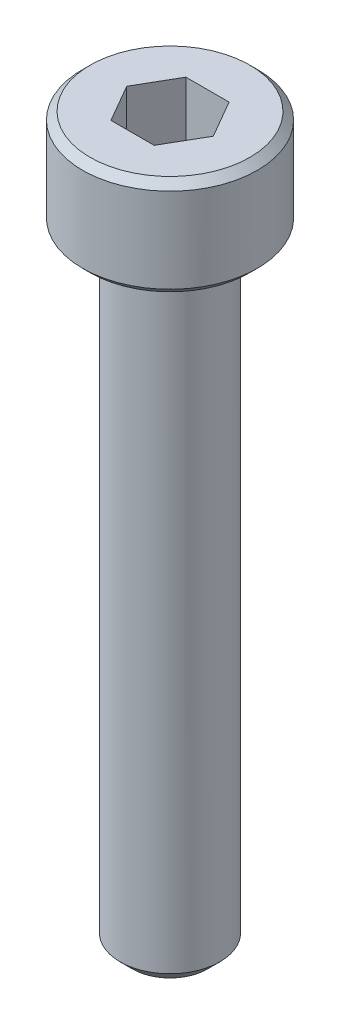
ISO-10303-21;
HEADER;
FILE_DESCRIPTION(('STEP AP214'),'2;1');
FILE_NAME('part.step','',(''),(''),'','','');
FILE_SCHEMA(('AUTOMOTIVE_DESIGN { 1 0 10303 214 1 1 1 1 }'));
ENDSEC;
DATA;
#1=APPLICATION_CONTEXT('core data for automotive mechanical design processes');
#2=APPLICATION_PROTOCOL_DEFINITION('international standard','automotive_design',2000,#1);
#3=PRODUCT_CONTEXT('',#1,'mechanical');
#4=PRODUCT('Part','Part','',(#3));
#5=PRODUCT_RELATED_PRODUCT_CATEGORY('part','',(#4));
#6=PRODUCT_DEFINITION_FORMATION('','',#4);
#7=PRODUCT_DEFINITION_CONTEXT('part definition',#1,'design');
#8=PRODUCT_DEFINITION('design','',#6,#7);
#9=PRODUCT_DEFINITION_SHAPE('','',#8);
#10=(LENGTH_UNIT() NAMED_UNIT(*) SI_UNIT(.MILLI.,.METRE.));
#11=(NAMED_UNIT(*) PLANE_ANGLE_UNIT() SI_UNIT($,.RADIAN.));
#12=(NAMED_UNIT(*) SI_UNIT($,.STERADIAN.) SOLID_ANGLE_UNIT());
#13=UNCERTAINTY_MEASURE_WITH_UNIT(LENGTH_MEASURE(1.E-05),#10,'distance_accuracy_value','');
#14=(GEOMETRIC_REPRESENTATION_CONTEXT(3) GLOBAL_UNCERTAINTY_ASSIGNED_CONTEXT((#13)) GLOBAL_UNIT_ASSIGNED_CONTEXT((#10,
#11,#12)) REPRESENTATION_CONTEXT('',''));
#15=CARTESIAN_POINT('',(0.,0.,0.));
#16=DIRECTION('',(0.,0.,1.));
#17=DIRECTION('',(1.,0.,0.));
#18=AXIS2_PLACEMENT_3D('',#15,#16,#17);
#19=CARTESIAN_POINT('',(0.866025403784439,26.,1.5));
#20=DIRECTION('',(0.866025403784439,0.,0.5));
#21=DIRECTION('',(0.5,0.,-0.866025403784439));
#22=AXIS2_PLACEMENT_3D('',#19,#20,#21);
#23=PLANE('',#22);
#24=DIRECTION('',(0.5,0.,-0.866025403784439));
#25=VECTOR('',#24,1.);
#26=CARTESIAN_POINT('',(0.866025403784439,26.,1.5));
#27=LINE('',#26,#25);
#28=CARTESIAN_POINT('',(0.866025403784439,26.,1.5));
#29=VERTEX_POINT('',#28);
#30=CARTESIAN_POINT('',(1.73205080756888,26.,0.));
#31=VERTEX_POINT('',#30);
#32=EDGE_CURVE('E66',#29,#31,#27,.T.);
#33=ORIENTED_EDGE('',*,*,#32,.F.);
#34=DIRECTION('',(0.,1.,0.));
#35=VECTOR('',#34,1.);
#36=CARTESIAN_POINT('',(0.866025403784439,26.,1.5));
#37=LINE('',#36,#35);
#38=CARTESIAN_POINT('',(0.866025403784439,29.,1.5));
#39=VERTEX_POINT('',#38);
#40=EDGE_CURVE('E85',#29,#39,#37,.T.);
#41=ORIENTED_EDGE('',*,*,#40,.T.);
#42=DIRECTION('',(0.5,0.,-0.866025403784439));
#43=VECTOR('',#42,1.);
#44=CARTESIAN_POINT('',(0.866025403784439,29.,1.5));
#45=LINE('',#44,#43);
#46=CARTESIAN_POINT('',(1.73205080756888,29.,0.));
#47=VERTEX_POINT('',#46);
#48=EDGE_CURVE('E73',#47,#39,#45,.F.);
#49=ORIENTED_EDGE('',*,*,#48,.F.);
#50=DIRECTION('',(0.,1.,0.));
#51=VECTOR('',#50,1.);
#52=CARTESIAN_POINT('',(1.73205080756888,26.,0.));
#53=LINE('',#52,#51);
#54=EDGE_CURVE('E80',#47,#31,#53,.F.);
#55=ORIENTED_EDGE('',*,*,#54,.T.);
#56=EDGE_LOOP('',(#33,#41,#49,#55));
#57=FACE_BOUND('',#56,.T.);
#58=ADVANCED_FACE('F17',(#57),#23,.F.);
#59=CARTESIAN_POINT('',(1.73205080756888,26.,0.));
#60=DIRECTION('',(0.866025403784438,0.,-0.5));
#61=DIRECTION('',(-0.5,0.,-0.866025403784438));
#62=AXIS2_PLACEMENT_3D('',#59,#60,#61);
#63=PLANE('',#62);
#64=DIRECTION('',(-0.5,0.,-0.866025403784438));
#65=VECTOR('',#64,1.);
#66=CARTESIAN_POINT('',(1.73205080756888,26.,0.));
#67=LINE('',#66,#65);
#68=CARTESIAN_POINT('',(0.866025403784438,26.,-1.5));
#69=VERTEX_POINT('',#68);
#70=EDGE_CURVE('E89',#31,#69,#67,.T.);
#71=ORIENTED_EDGE('',*,*,#70,.F.);
#72=ORIENTED_EDGE('',*,*,#54,.F.);
#73=DIRECTION('',(-0.5,0.,-0.866025403784438));
#74=VECTOR('',#73,1.);
#75=CARTESIAN_POINT('',(1.73205080756888,29.,0.));
#76=LINE('',#75,#74);
#77=CARTESIAN_POINT('',(0.866025403784439,29.,-1.5));
#78=VERTEX_POINT('',#77);
#79=EDGE_CURVE('E70',#78,#47,#76,.F.);
#80=ORIENTED_EDGE('',*,*,#79,.F.);
#81=DIRECTION('',(0.,1.,0.));
#82=VECTOR('',#81,1.);
#83=CARTESIAN_POINT('',(0.866025403784438,26.,-1.5));
#84=LINE('',#83,#82);
#85=EDGE_CURVE('E133',#78,#69,#84,.F.);
#86=ORIENTED_EDGE('',*,*,#85,.T.);
#87=EDGE_LOOP('',(#71,#72,#80,#86));
#88=FACE_BOUND('',#87,.T.);
#89=ADVANCED_FACE('F88',(#88),#63,.F.);
#90=CARTESIAN_POINT('',(-0.866025403784438,26.,1.5));
#91=DIRECTION('',(0.,0.,1.));
#92=DIRECTION('',(1.,0.,0.));
#93=AXIS2_PLACEMENT_3D('',#90,#91,#92);
#94=PLANE('',#93);
#95=DIRECTION('',(1.,0.,0.));
#96=VECTOR('',#95,1.);
#97=CARTESIAN_POINT('',(1.73205080756888,26.,1.5));
#98=LINE('',#97,#96);
#99=CARTESIAN_POINT('',(-0.866025403784438,26.,1.5));
#100=VERTEX_POINT('',#99);
#101=EDGE_CURVE('E131',#100,#29,#98,.T.);
#102=ORIENTED_EDGE('',*,*,#101,.F.);
#103=DIRECTION('',(0.,1.,0.));
#104=VECTOR('',#103,1.);
#105=CARTESIAN_POINT('',(-0.866025403784438,26.,1.5));
#106=LINE('',#105,#104);
#107=CARTESIAN_POINT('',(-0.866025403784438,29.,1.5));
#108=VERTEX_POINT('',#107);
#109=EDGE_CURVE('E121',#100,#108,#106,.T.);
#110=ORIENTED_EDGE('',*,*,#109,.T.);
#111=DIRECTION('',(1.,0.,0.));
#112=VECTOR('',#111,1.);
#113=CARTESIAN_POINT('',(-0.866025403784438,29.,1.5));
#114=LINE('',#113,#112);
#115=EDGE_CURVE('E91',#39,#108,#114,.F.);
#116=ORIENTED_EDGE('',*,*,#115,.F.);
#117=ORIENTED_EDGE('',*,*,#40,.F.);
#118=EDGE_LOOP('',(#102,#110,#116,#117));
#119=FACE_BOUND('',#118,.T.);
#120=ADVANCED_FACE('F138',(#119),#94,.F.);
#121=CARTESIAN_POINT('',(0.866025403784438,26.,-1.5));
#122=DIRECTION('',(0.,0.,-1.));
#123=DIRECTION('',(-1.,0.,0.));
#124=AXIS2_PLACEMENT_3D('',#121,#122,#123);
#125=PLANE('',#124);
#126=DIRECTION('',(1.,0.,0.));
#127=VECTOR('',#126,1.);
#128=CARTESIAN_POINT('',(1.73205080756888,26.,-1.5));
#129=LINE('',#128,#127);
#130=CARTESIAN_POINT('',(-0.866025403784438,26.,-1.5));
#131=VERTEX_POINT('',#130);
#132=EDGE_CURVE('E128',#69,#131,#129,.F.);
#133=ORIENTED_EDGE('',*,*,#132,.F.);
#134=ORIENTED_EDGE('',*,*,#85,.F.);
#135=DIRECTION('',(-1.,0.,0.));
#136=VECTOR('',#135,1.);
#137=CARTESIAN_POINT('',(0.866025403784438,29.,-1.5));
#138=LINE('',#137,#136);
#139=CARTESIAN_POINT('',(-0.866025403784438,29.,-1.5));
#140=VERTEX_POINT('',#139);
#141=EDGE_CURVE('E75',#140,#78,#138,.F.);
#142=ORIENTED_EDGE('',*,*,#141,.F.);
#143=DIRECTION('',(0.,1.,0.));
#144=VECTOR('',#143,1.);
#145=CARTESIAN_POINT('',(-0.866025403784438,26.,-1.5));
#146=LINE('',#145,#144);
#147=EDGE_CURVE('E119',#140,#131,#146,.F.);
#148=ORIENTED_EDGE('',*,*,#147,.T.);
#149=EDGE_LOOP('',(#133,#134,#142,#148));
#150=FACE_BOUND('',#149,.T.);
#151=ADVANCED_FACE('F150',(#150),#125,.F.);
#152=CARTESIAN_POINT('',(1.73205080756888,26.,0.));
#153=DIRECTION('',(0.,1.,0.));
#154=DIRECTION('',(0.,0.,1.));
#155=AXIS2_PLACEMENT_3D('',#152,#153,#154);
#156=PLANE('',#155);
#157=ORIENTED_EDGE('',*,*,#132,.T.);
#158=DIRECTION('',(-0.5,0.,0.866025403784439));
#159=VECTOR('',#158,1.);
#160=CARTESIAN_POINT('',(-0.866025403784438,26.,-1.5));
#161=LINE('',#160,#159);
#162=CARTESIAN_POINT('',(-1.73205080756888,26.,0.));
#163=VERTEX_POINT('',#162);
#164=EDGE_CURVE('E117',#131,#163,#161,.T.);
#165=ORIENTED_EDGE('',*,*,#164,.T.);
#166=DIRECTION('',(0.5,0.,0.866025403784439));
#167=VECTOR('',#166,1.);
#168=CARTESIAN_POINT('',(-1.73205080756888,26.,0.));
#169=LINE('',#168,#167);
#170=EDGE_CURVE('E124',#163,#100,#169,.T.);
#171=ORIENTED_EDGE('',*,*,#170,.T.);
#172=ORIENTED_EDGE('',*,*,#101,.T.);
#173=ORIENTED_EDGE('',*,*,#32,.T.);
#174=ORIENTED_EDGE('',*,*,#70,.T.);
#175=EDGE_LOOP('',(#157,#165,#171,#172,#173,#174));
#176=FACE_BOUND('',#175,.T.);
#177=ADVANCED_FACE('F151',(#176),#156,.T.);
#178=CARTESIAN_POINT('',(-1.73205080756888,26.,0.));
#179=DIRECTION('',(-0.866025403784439,0.,0.5));
#180=DIRECTION('',(0.5,0.,0.866025403784439));
#181=AXIS2_PLACEMENT_3D('',#178,#179,#180);
#182=PLANE('',#181);
#183=ORIENTED_EDGE('',*,*,#170,.F.);
#184=DIRECTION('',(0.,1.,0.));
#185=VECTOR('',#184,1.);
#186=CARTESIAN_POINT('',(-1.73205080756888,26.,0.));
#187=LINE('',#186,#185);
#188=CARTESIAN_POINT('',(-1.73205080756888,29.,0.));
#189=VERTEX_POINT('',#188);
#190=EDGE_CURVE('E115',#163,#189,#187,.T.);
#191=ORIENTED_EDGE('',*,*,#190,.T.);
#192=DIRECTION('',(0.5,0.,0.866025403784439));
#193=VECTOR('',#192,1.);
#194=CARTESIAN_POINT('',(-1.73205080756888,29.,0.));
#195=LINE('',#194,#193);
#196=EDGE_CURVE('E35',#108,#189,#195,.F.);
#197=ORIENTED_EDGE('',*,*,#196,.F.);
#198=ORIENTED_EDGE('',*,*,#109,.F.);
#199=EDGE_LOOP('',(#183,#191,#197,#198));
#200=FACE_BOUND('',#199,.T.);
#201=ADVANCED_FACE('F141',(#200),#182,.F.);
#202=CARTESIAN_POINT('',(-0.866025403784438,26.,-1.5));
#203=DIRECTION('',(-0.866025403784439,0.,-0.5));
#204=DIRECTION('',(-0.5,0.,0.866025403784439));
#205=AXIS2_PLACEMENT_3D('',#202,#203,#204);
#206=PLANE('',#205);
#207=ORIENTED_EDGE('',*,*,#164,.F.);
#208=ORIENTED_EDGE('',*,*,#147,.F.);
#209=DIRECTION('',(0.5,0.,-0.866025403784439));
#210=VECTOR('',#209,1.);
#211=CARTESIAN_POINT('',(-1.73205080756888,29.,0.));
#212=LINE('',#211,#210);
#213=EDGE_CURVE('E113',#189,#140,#212,.T.);
#214=ORIENTED_EDGE('',*,*,#213,.F.);
#215=ORIENTED_EDGE('',*,*,#190,.F.);
#216=EDGE_LOOP('',(#207,#208,#214,#215));
#217=FACE_BOUND('',#216,.T.);
#218=ADVANCED_FACE('F147',(#217),#206,.F.);
#219=CARTESIAN_POINT('',(0.,29.,-3.5));
#220=DIRECTION('',(0.,1.,0.));
#221=DIRECTION('',(0.,0.,1.));
#222=AXIS2_PLACEMENT_3D('',#219,#220,#221);
#223=PLANE('',#222);
#224=CARTESIAN_POINT('',(0.,29.0000000000532,0.));
#225=DIRECTION('',(0.,-1.,0.));
#226=DIRECTION('',(1.,0.,0.));
#227=AXIS2_PLACEMENT_3D('',#224,#225,#226);
#228=CIRCLE('',#227,3.19999999999254);
#229=CARTESIAN_POINT('',(3.19999999999254,29.0000000000532,0.));
#230=VERTEX_POINT('',#229);
#231=EDGE_CURVE('E20',#230,#230,#228,.T.);
#232=ORIENTED_EDGE('',*,*,#231,.F.);
#233=EDGE_LOOP('',(#232));
#234=FACE_BOUND('',#233,.T.);
#235=ORIENTED_EDGE('',*,*,#196,.T.);
#236=ORIENTED_EDGE('',*,*,#213,.T.);
#237=ORIENTED_EDGE('',*,*,#141,.T.);
#238=ORIENTED_EDGE('',*,*,#79,.T.);
#239=ORIENTED_EDGE('',*,*,#48,.T.);
#240=ORIENTED_EDGE('',*,*,#115,.T.);
#241=EDGE_LOOP('',(#235,#236,#237,#238,#239,#240));
#242=FACE_BOUND('',#241,.T.);
#243=ADVANCED_FACE('F72',(#234,#242),#223,.T.);
#244=CARTESIAN_POINT('',(0.,28.7000000000717,0.));
#245=DIRECTION('',(0.,-1.,0.));
#246=DIRECTION('',(1.,0.,0.));
#247=AXIS2_PLACEMENT_3D('',#244,#245,#246);
#248=CONICAL_SURFACE('',#247,3.49999999997408,0.785398163397448);
#249=CARTESIAN_POINT('',(0.,28.7,0.));
#250=DIRECTION('',(0.,-1.,0.));
#251=DIRECTION('',(0.,0.,-1.));
#252=AXIS2_PLACEMENT_3D('',#249,#250,#251);
#253=CIRCLE('',#252,3.5);
#254=CARTESIAN_POINT('',(0.,28.7,-3.5));
#255=VERTEX_POINT('',#254);
#256=EDGE_CURVE('E106',#255,#255,#253,.T.);
#257=ORIENTED_EDGE('',*,*,#256,.F.);
#258=EDGE_LOOP('',(#257));
#259=FACE_BOUND('',#258,.T.);
#260=ORIENTED_EDGE('',*,*,#231,.T.);
#261=EDGE_LOOP('',(#260));
#262=FACE_BOUND('',#261,.T.);
#263=ADVANCED_FACE('F186',(#259,#262),#248,.T.);
#264=CARTESIAN_POINT('',(0.,0.,0.));
#265=DIRECTION('',(0.,-1.,0.));
#266=DIRECTION('',(0.,0.,-1.));
#267=AXIS2_PLACEMENT_3D('',#264,#265,#266);
#268=CYLINDRICAL_SURFACE('',#267,3.5);
#269=CARTESIAN_POINT('',(0.,25.2999999999588,0.));
#270=DIRECTION('',(0.,1.,0.));
#271=DIRECTION('',(0.,0.,1.));
#272=AXIS2_PLACEMENT_3D('',#269,#270,#271);
#273=CIRCLE('',#272,3.49999999997408);
#274=CARTESIAN_POINT('',(0.,25.2999999999588,3.49999999997408));
#275=VERTEX_POINT('',#274);
#276=EDGE_CURVE('E102',#275,#275,#273,.F.);
#277=ORIENTED_EDGE('',*,*,#276,.F.);
#278=EDGE_LOOP('',(#277));
#279=FACE_BOUND('',#278,.T.);
#280=ORIENTED_EDGE('',*,*,#256,.T.);
#281=EDGE_LOOP('',(#280));
#282=FACE_BOUND('',#281,.T.);
#283=ADVANCED_FACE('F183',(#279,#282),#268,.T.);
#284=CARTESIAN_POINT('',(0.,25.299999999902,0.));
#285=DIRECTION('',(0.,1.,0.));
#286=DIRECTION('',(0.,0.,1.));
#287=AXIS2_PLACEMENT_3D('',#284,#285,#286);
#288=CONICAL_SURFACE('',#287,3.49999999991724,0.785398163397448);
#289=ORIENTED_EDGE('',*,*,#276,.T.);
#290=EDGE_LOOP('',(#289));
#291=FACE_BOUND('',#290,.T.);
#292=CARTESIAN_POINT('',(0.,24.9999999999773,0.));
#293=DIRECTION('',(0.,1.,0.));
#294=DIRECTION('',(0.,0.,1.));
#295=AXIS2_PLACEMENT_3D('',#292,#293,#294);
#296=CIRCLE('',#295,3.19999999999254);
#297=CARTESIAN_POINT('',(0.,24.9999999999773,3.19999999999254));
#298=VERTEX_POINT('',#297);
#299=EDGE_CURVE('E100',#298,#298,#296,.F.);
#300=ORIENTED_EDGE('',*,*,#299,.F.);
#301=EDGE_LOOP('',(#300));
#302=FACE_BOUND('',#301,.T.);
#303=ADVANCED_FACE('F179',(#291,#302),#288,.T.);
#304=CARTESIAN_POINT('',(0.,0.,0.));
#305=DIRECTION('',(0.,-1.,0.));
#306=DIRECTION('',(0.,0.,-1.));
#307=AXIS2_PLACEMENT_3D('',#304,#305,#306);
#308=PLANE('',#307);
#309=CARTESIAN_POINT('',(0.,5.68433104405908E-11,0.));
#310=DIRECTION('',(0.,1.,0.));
#311=DIRECTION('',(0.,0.,1.));
#312=AXIS2_PLACEMENT_3D('',#309,#310,#311);
#313=CIRCLE('',#312,1.50000000002137);
#314=CARTESIAN_POINT('',(0.,5.68433104405908E-11,1.50000000002137));
#315=VERTEX_POINT('',#314);
#316=EDGE_CURVE('E98',#315,#315,#313,.T.);
#317=ORIENTED_EDGE('',*,*,#316,.F.);
#318=EDGE_LOOP('',(#317));
#319=FACE_BOUND('',#318,.T.);
#320=ADVANCED_FACE('F176',(#319),#308,.T.);
#321=CARTESIAN_POINT('',(0.,25.,-2.));
#322=DIRECTION('',(0.,-1.,0.));
#323=DIRECTION('',(0.,0.,-1.));
#324=AXIS2_PLACEMENT_3D('',#321,#322,#323);
#325=PLANE('',#324);
#326=ORIENTED_EDGE('',*,*,#299,.T.);
#327=EDGE_LOOP('',(#326));
#328=FACE_BOUND('',#327,.T.);
#329=CARTESIAN_POINT('',(0.,25.,0.));
#330=DIRECTION('',(0.,-1.,0.));
#331=DIRECTION('',(0.,0.,-1.));
#332=AXIS2_PLACEMENT_3D('',#329,#330,#331);
#333=CIRCLE('',#332,2.);
#334=CARTESIAN_POINT('',(0.,25.,-2.));
#335=VERTEX_POINT('',#334);
#336=EDGE_CURVE('E26',#335,#335,#333,.T.);
#337=ORIENTED_EDGE('',*,*,#336,.F.);
#338=EDGE_LOOP('',(#337));
#339=FACE_BOUND('',#338,.T.);
#340=ADVANCED_FACE('F169',(#328,#339),#325,.T.);
#341=CARTESIAN_POINT('',(0.,0.49999999987449,0.));
#342=DIRECTION('',(0.,1.,0.));
#343=DIRECTION('',(0.,0.,1.));
#344=AXIS2_PLACEMENT_3D('',#341,#342,#343);
#345=CONICAL_SURFACE('',#344,1.99999999989586,0.785398163454292);
#346=CARTESIAN_POINT('',(0.,0.500000000000009,0.));
#347=DIRECTION('',(0.,-1.,0.));
#348=DIRECTION('',(0.,0.,-1.));
#349=AXIS2_PLACEMENT_3D('',#346,#347,#348);
#350=CIRCLE('',#349,2.);
#351=CARTESIAN_POINT('',(0.,0.500000000000009,-2.));
#352=VERTEX_POINT('',#351);
#353=EDGE_CURVE('E11',#352,#352,#350,.F.);
#354=ORIENTED_EDGE('',*,*,#353,.F.);
#355=EDGE_LOOP('',(#354));
#356=FACE_BOUND('',#355,.T.);
#357=ORIENTED_EDGE('',*,*,#316,.T.);
#358=EDGE_LOOP('',(#357));
#359=FACE_BOUND('',#358,.T.);
#360=ADVANCED_FACE('F163',(#356,#359),#345,.T.);
#361=CARTESIAN_POINT('',(0.,0.,0.));
#362=DIRECTION('',(0.,-1.,0.));
#363=DIRECTION('',(0.,0.,-1.));
#364=AXIS2_PLACEMENT_3D('',#361,#362,#363);
#365=CYLINDRICAL_SURFACE('',#364,2.);
#366=ORIENTED_EDGE('',*,*,#353,.T.);
#367=EDGE_LOOP('',(#366));
#368=FACE_BOUND('',#367,.T.);
#369=ORIENTED_EDGE('',*,*,#336,.T.);
#370=EDGE_LOOP('',(#369));
#371=FACE_BOUND('',#370,.T.);
#372=ADVANCED_FACE('F161',(#368,#371),#365,.T.);
#373=CLOSED_SHELL('',(#58,#89,#120,#151,#177,#201,#218,#243,#263,#283,#303,#320,#340,#360,#372));
#374=MANIFOLD_SOLID_BREP('B1',#373);
#375=ADVANCED_BREP_SHAPE_REPRESENTATION('',(#18,#374),#14);
#376=SHAPE_DEFINITION_REPRESENTATION(#9,#375);
ENDSEC;
END-ISO-10303-21;
